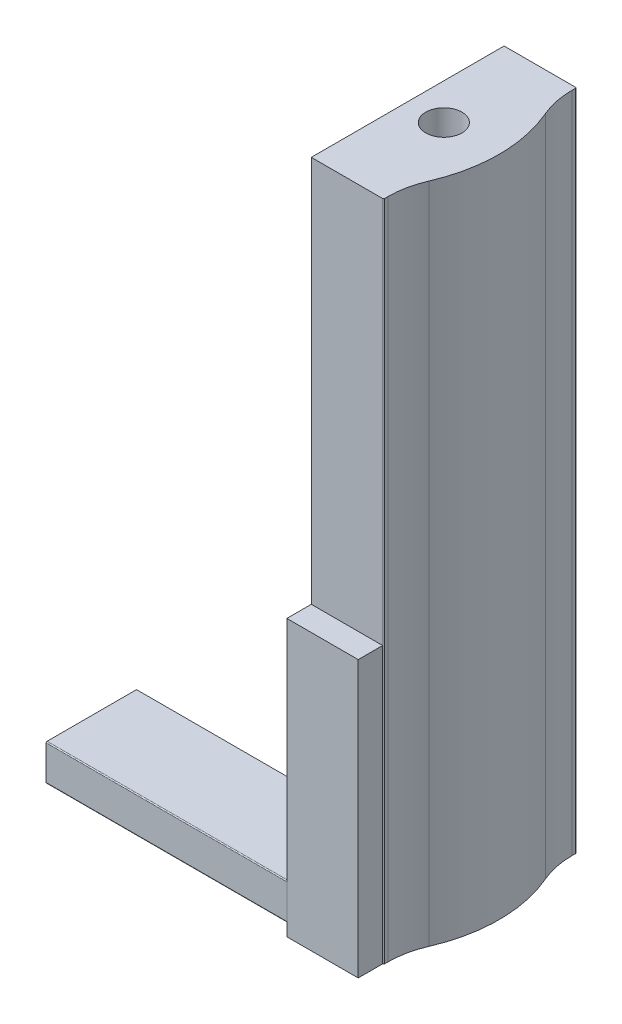
ISO-10303-21;
HEADER;
FILE_DESCRIPTION(('STEP AP214'),'2;1');
FILE_NAME('part.step','',(''),(''),'','','');
FILE_SCHEMA(('AUTOMOTIVE_DESIGN { 1 0 10303 214 1 1 1 1 }'));
ENDSEC;
DATA;
#1=APPLICATION_CONTEXT('core data for automotive mechanical design processes');
#2=APPLICATION_PROTOCOL_DEFINITION('international standard','automotive_design',2000,#1);
#3=PRODUCT_CONTEXT('',#1,'mechanical');
#4=PRODUCT('Part','Part','',(#3));
#5=PRODUCT_RELATED_PRODUCT_CATEGORY('part','',(#4));
#6=PRODUCT_DEFINITION_FORMATION('','',#4);
#7=PRODUCT_DEFINITION_CONTEXT('part definition',#1,'design');
#8=PRODUCT_DEFINITION('design','',#6,#7);
#9=PRODUCT_DEFINITION_SHAPE('','',#8);
#10=(LENGTH_UNIT() NAMED_UNIT(*) SI_UNIT(.MILLI.,.METRE.));
#11=(NAMED_UNIT(*) PLANE_ANGLE_UNIT() SI_UNIT($,.RADIAN.));
#12=(NAMED_UNIT(*) SI_UNIT($,.STERADIAN.) SOLID_ANGLE_UNIT());
#13=UNCERTAINTY_MEASURE_WITH_UNIT(LENGTH_MEASURE(1.E-05),#10,'distance_accuracy_value','');
#14=(GEOMETRIC_REPRESENTATION_CONTEXT(3) GLOBAL_UNCERTAINTY_ASSIGNED_CONTEXT((#13)) GLOBAL_UNIT_ASSIGNED_CONTEXT((#10,
#11,#12)) REPRESENTATION_CONTEXT('',''));
#15=CARTESIAN_POINT('',(0.,0.,0.));
#16=DIRECTION('',(0.,0.,1.));
#17=DIRECTION('',(1.,0.,0.));
#18=AXIS2_PLACEMENT_3D('',#15,#16,#17);
#19=CARTESIAN_POINT('',(1.43662773521287,43.65625,-8.23400967464864));
#20=DIRECTION('',(0.,-1.,0.));
#21=DIRECTION('',(0.,0.,-1.));
#22=AXIS2_PLACEMENT_3D('',#19,#20,#21);
#23=CYLINDRICAL_SURFACE('',#22,0.0634999999999996);
#24=CARTESIAN_POINT('',(1.43662773521287,0.,-8.23400967464864));
#25=DIRECTION('',(0.,1.,0.));
#26=DIRECTION('',(0.,0.,1.));
#27=AXIS2_PLACEMENT_3D('',#24,#25,#26);
#28=CIRCLE('',#27,0.0634999999999996);
#29=CARTESIAN_POINT('',(1.43662773521287,0.,-8.29750967464864));
#30=VERTEX_POINT('',#29);
#31=CARTESIAN_POINT('',(1.50012773521287,0.,-8.23400967464864));
#32=VERTEX_POINT('',#31);
#33=EDGE_CURVE('E250',#30,#32,#28,.F.);
#34=ORIENTED_EDGE('',*,*,#33,.F.);
#35=DIRECTION('',(0.,-1.,0.));
#36=VECTOR('',#35,1.);
#37=CARTESIAN_POINT('',(1.43662773521287,43.65625,-8.29750967464864));
#38=LINE('',#37,#36);
#39=CARTESIAN_POINT('',(1.43662773521287,43.65625,-8.29750967464864));
#40=VERTEX_POINT('',#39);
#41=EDGE_CURVE('E46',#40,#30,#38,.T.);
#42=ORIENTED_EDGE('',*,*,#41,.F.);
#43=CARTESIAN_POINT('',(1.43662773521287,43.65625,-8.23400967464864));
#44=DIRECTION('',(0.,1.,0.));
#45=DIRECTION('',(0.,0.,1.));
#46=AXIS2_PLACEMENT_3D('',#43,#44,#45);
#47=CIRCLE('',#46,0.0634999999999996);
#48=CARTESIAN_POINT('',(1.50012773521287,43.65625,-8.23400967464864));
#49=VERTEX_POINT('',#48);
#50=EDGE_CURVE('E225',#40,#49,#47,.F.);
#51=ORIENTED_EDGE('',*,*,#50,.T.);
#52=DIRECTION('',(0.,-1.,0.));
#53=VECTOR('',#52,1.);
#54=CARTESIAN_POINT('',(1.50012773521287,43.65625,-8.23400967464864));
#55=LINE('',#54,#53);
#56=EDGE_CURVE('E219',#49,#32,#55,.T.);
#57=ORIENTED_EDGE('',*,*,#56,.T.);
#58=EDGE_LOOP('',(#34,#42,#51,#57));
#59=FACE_BOUND('',#58,.T.);
#60=ADVANCED_FACE('F43',(#59),#23,.T.);
#61=CARTESIAN_POINT('',(0.,43.65625,-8.29750967464864));
#62=DIRECTION('',(0.,0.,-1.));
#63=DIRECTION('',(-1.,0.,0.));
#64=AXIS2_PLACEMENT_3D('',#61,#62,#63);
#65=PLANE('',#64);
#66=DIRECTION('',(1.,0.,0.));
#67=VECTOR('',#66,1.);
#68=CARTESIAN_POINT('',(0.,0.,-8.29750967464864));
#69=LINE('',#68,#67);
#70=CARTESIAN_POINT('',(-3.26237226478714,0.,-8.29750967464864));
#71=VERTEX_POINT('',#70);
#72=EDGE_CURVE('E247',#71,#30,#69,.T.);
#73=ORIENTED_EDGE('',*,*,#72,.F.);
#74=DIRECTION('',(0.,-1.,0.));
#75=VECTOR('',#74,1.);
#76=CARTESIAN_POINT('',(-3.26237226478714,43.65625,-8.29750967464864));
#77=LINE('',#76,#75);
#78=CARTESIAN_POINT('',(-3.26237226478714,43.65625,-8.29750967464864));
#79=VERTEX_POINT('',#78);
#80=EDGE_CURVE('E204',#79,#71,#77,.T.);
#81=ORIENTED_EDGE('',*,*,#80,.F.);
#82=DIRECTION('',(1.,0.,0.));
#83=VECTOR('',#82,1.);
#84=CARTESIAN_POINT('',(0.,43.65625,-8.29750967464864));
#85=LINE('',#84,#83);
#86=EDGE_CURVE('E275',#79,#40,#85,.T.);
#87=ORIENTED_EDGE('',*,*,#86,.T.);
#88=ORIENTED_EDGE('',*,*,#41,.T.);
#89=EDGE_LOOP('',(#73,#81,#87,#88));
#90=FACE_BOUND('',#89,.T.);
#91=ADVANCED_FACE('F362',(#90),#65,.T.);
#92=CARTESIAN_POINT('',(-3.26237226478714,43.65625,0.));
#93=DIRECTION('',(-1.,0.,0.));
#94=DIRECTION('',(0.,0.,1.));
#95=AXIS2_PLACEMENT_3D('',#92,#93,#94);
#96=PLANE('',#95);
#97=DIRECTION('',(0.,0.,-1.));
#98=VECTOR('',#97,1.);
#99=CARTESIAN_POINT('',(-3.26237226478714,3.175,0.0368653253513575));
#100=LINE('',#99,#98);
#101=CARTESIAN_POINT('',(-3.26237226478714,3.175,5.92649032535136));
#102=VERTEX_POINT('',#101);
#103=CARTESIAN_POINT('',(-3.26237226478714,3.175,0.0368653253513575));
#104=VERTEX_POINT('',#103);
#105=EDGE_CURVE('E11',#102,#104,#100,.T.);
#106=ORIENTED_EDGE('',*,*,#105,.F.);
#107=CARTESIAN_POINT('',(-3.26237226478714,3.1115,5.92649032535136));
#108=DIRECTION('',(-1.,0.,0.));
#109=DIRECTION('',(0.,0.,1.));
#110=AXIS2_PLACEMENT_3D('',#107,#108,#109);
#111=CIRCLE('',#110,0.0635000000000002);
#112=CARTESIAN_POINT('',(-3.26237226478714,3.1115,5.98999032535136));
#113=VERTEX_POINT('',#112);
#114=EDGE_CURVE('E302',#113,#102,#111,.T.);
#115=ORIENTED_EDGE('',*,*,#114,.F.);
#116=DIRECTION('',(0.,1.,0.));
#117=VECTOR('',#116,1.);
#118=CARTESIAN_POINT('',(-3.26237226478714,3.1115,5.98999032535136));
#119=LINE('',#118,#117);
#120=CARTESIAN_POINT('',(-3.26237226478714,0.85725,5.98999032535136));
#121=VERTEX_POINT('',#120);
#122=EDGE_CURVE('E306',#121,#113,#119,.T.);
#123=ORIENTED_EDGE('',*,*,#122,.F.);
#124=CARTESIAN_POINT('',(-3.26237226478714,0.85725,5.92649032535136));
#125=DIRECTION('',(-1.,0.,0.));
#126=DIRECTION('',(0.,0.,-1.));
#127=AXIS2_PLACEMENT_3D('',#124,#125,#126);
#128=CIRCLE('',#127,0.0635000000000001);
#129=CARTESIAN_POINT('',(-3.26237226478714,0.79375,5.92649032535136));
#130=VERTEX_POINT('',#129);
#131=EDGE_CURVE('E309',#130,#121,#128,.T.);
#132=ORIENTED_EDGE('',*,*,#131,.F.);
#133=DIRECTION('',(0.,0.,1.));
#134=VECTOR('',#133,1.);
#135=CARTESIAN_POINT('',(-3.26237226478714,0.79375,5.92649032535136));
#136=LINE('',#135,#134);
#137=CARTESIAN_POINT('',(-3.26237226478714,0.793749999999999,0.100365325351358));
#138=VERTEX_POINT('',#137);
#139=EDGE_CURVE('E312',#138,#130,#136,.T.);
#140=ORIENTED_EDGE('',*,*,#139,.F.);
#141=CARTESIAN_POINT('',(-3.26237226478714,0.857249999999999,0.100365325351357));
#142=DIRECTION('',(-1.,0.,0.));
#143=DIRECTION('',(0.,0.,-1.));
#144=AXIS2_PLACEMENT_3D('',#141,#142,#143);
#145=CIRCLE('',#144,0.0635);
#146=CARTESIAN_POINT('',(-3.26237226478714,0.857249999999999,0.0368653253513575));
#147=VERTEX_POINT('',#146);
#148=EDGE_CURVE('E62',#147,#138,#145,.T.);
#149=ORIENTED_EDGE('',*,*,#148,.F.);
#150=DIRECTION('',(0.,-1.,0.));
#151=VECTOR('',#150,1.);
#152=CARTESIAN_POINT('',(-3.26237226478714,0.857249999999999,0.0368653253513575));
#153=LINE('',#152,#151);
#154=EDGE_CURVE('E58',#104,#147,#153,.T.);
#155=ORIENTED_EDGE('',*,*,#154,.F.);
#156=EDGE_LOOP('',(#106,#115,#123,#132,#140,#149,#155));
#157=FACE_BOUND('',#156,.T.);
#158=DIRECTION('',(0.,0.,-1.));
#159=VECTOR('',#158,1.);
#160=CARTESIAN_POINT('',(-3.26237226478714,18.161,4.40249032535135));
#161=LINE('',#160,#159);
#162=CARTESIAN_POINT('',(-3.26237226478714,18.161,6.01176945700622));
#163=VERTEX_POINT('',#162);
#164=CARTESIAN_POINT('',(-3.26237226478714,18.161,4.40249032535135));
#165=VERTEX_POINT('',#164);
#166=EDGE_CURVE('E181',#163,#165,#161,.T.);
#167=ORIENTED_EDGE('',*,*,#166,.T.);
#168=DIRECTION('',(0.,-1.,0.));
#169=VECTOR('',#168,1.);
#170=CARTESIAN_POINT('',(-3.26237226478714,43.65625,4.40249032535135));
#171=LINE('',#170,#169);
#172=CARTESIAN_POINT('',(-3.26237226478714,43.65625,4.40249032535135));
#173=VERTEX_POINT('',#172);
#174=EDGE_CURVE('E194',#173,#165,#171,.T.);
#175=ORIENTED_EDGE('',*,*,#174,.F.);
#176=DIRECTION('',(0.,0.,-1.));
#177=VECTOR('',#176,1.);
#178=CARTESIAN_POINT('',(-3.26237226478714,43.65625,0.));
#179=LINE('',#178,#177);
#180=EDGE_CURVE('E273',#173,#79,#179,.T.);
#181=ORIENTED_EDGE('',*,*,#180,.T.);
#182=ORIENTED_EDGE('',*,*,#80,.T.);
#183=DIRECTION('',(0.,0.,-1.));
#184=VECTOR('',#183,1.);
#185=CARTESIAN_POINT('',(-3.26237226478714,0.,0.));
#186=LINE('',#185,#184);
#187=CARTESIAN_POINT('',(-3.26237226478714,0.,6.01176945700622));
#188=VERTEX_POINT('',#187);
#189=EDGE_CURVE('E244',#188,#71,#186,.T.);
#190=ORIENTED_EDGE('',*,*,#189,.F.);
#191=DIRECTION('',(0.,-1.,0.));
#192=VECTOR('',#191,1.);
#193=CARTESIAN_POINT('',(-3.26237226478714,18.161,6.01176945700622));
#194=LINE('',#193,#192);
#195=EDGE_CURVE('E197',#163,#188,#194,.T.);
#196=ORIENTED_EDGE('',*,*,#195,.F.);
#197=EDGE_LOOP('',(#167,#175,#181,#182,#190,#196));
#198=FACE_BOUND('',#197,.T.);
#199=ADVANCED_FACE('F192',(#157,#198),#96,.T.);
#200=CARTESIAN_POINT('',(0.,43.65625,4.40249032535135));
#201=DIRECTION('',(0.,0.,1.));
#202=DIRECTION('',(1.,0.,0.));
#203=AXIS2_PLACEMENT_3D('',#200,#201,#202);
#204=PLANE('',#203);
#205=DIRECTION('',(1.,0.,0.));
#206=VECTOR('',#205,1.);
#207=CARTESIAN_POINT('',(-3.26237226478714,18.161,4.40249032535135));
#208=LINE('',#207,#206);
#209=CARTESIAN_POINT('',(1.43662773521287,18.161,4.40249032535135));
#210=VERTEX_POINT('',#209);
#211=EDGE_CURVE('E177',#165,#210,#208,.T.);
#212=ORIENTED_EDGE('',*,*,#211,.T.);
#213=DIRECTION('',(0.,-1.,0.));
#214=VECTOR('',#213,1.);
#215=CARTESIAN_POINT('',(1.43662773521287,43.65625,4.40249032535135));
#216=LINE('',#215,#214);
#217=CARTESIAN_POINT('',(1.43662773521287,43.65625,4.40249032535135));
#218=VERTEX_POINT('',#217);
#219=EDGE_CURVE('E205',#218,#210,#216,.T.);
#220=ORIENTED_EDGE('',*,*,#219,.F.);
#221=DIRECTION('',(-1.,0.,0.));
#222=VECTOR('',#221,1.);
#223=CARTESIAN_POINT('',(0.,43.65625,4.40249032535135));
#224=LINE('',#223,#222);
#225=EDGE_CURVE('E203',#218,#173,#224,.T.);
#226=ORIENTED_EDGE('',*,*,#225,.T.);
#227=ORIENTED_EDGE('',*,*,#174,.T.);
#228=EDGE_LOOP('',(#212,#220,#226,#227));
#229=FACE_BOUND('',#228,.T.);
#230=ADVANCED_FACE('F201',(#229),#204,.T.);
#231=CARTESIAN_POINT('',(1.43662773521287,43.65625,4.33899032535135));
#232=DIRECTION('',(0.,-1.,0.));
#233=DIRECTION('',(0.,0.,-1.));
#234=AXIS2_PLACEMENT_3D('',#231,#232,#233);
#235=CYLINDRICAL_SURFACE('',#234,0.0635000000000001);
#236=CARTESIAN_POINT('',(1.43662773521287,0.,4.33899032535135));
#237=DIRECTION('',(0.,1.,0.));
#238=DIRECTION('',(0.,0.,1.));
#239=AXIS2_PLACEMENT_3D('',#236,#237,#238);
#240=CIRCLE('',#239,0.0635000000000001);
#241=CARTESIAN_POINT('',(1.50012773521287,0.,4.33899032535135));
#242=VERTEX_POINT('',#241);
#243=CARTESIAN_POINT('',(1.43693305592003,0.,4.40249032535135));
#244=VERTEX_POINT('',#243);
#245=EDGE_CURVE('E241',#242,#244,#240,.F.);
#246=ORIENTED_EDGE('',*,*,#245,.F.);
#247=DIRECTION('',(0.,-1.,0.));
#248=VECTOR('',#247,1.);
#249=CARTESIAN_POINT('',(1.50012773521287,43.65625,4.33899032535135));
#250=LINE('',#249,#248);
#251=CARTESIAN_POINT('',(1.50012773521287,43.65625,4.33899032535135));
#252=VERTEX_POINT('',#251);
#253=EDGE_CURVE('E207',#252,#242,#250,.T.);
#254=ORIENTED_EDGE('',*,*,#253,.F.);
#255=CARTESIAN_POINT('',(1.43662773521287,43.65625,4.33899032535135));
#256=DIRECTION('',(0.,1.,0.));
#257=DIRECTION('',(0.,0.,1.));
#258=AXIS2_PLACEMENT_3D('',#255,#256,#257);
#259=CIRCLE('',#258,0.0635000000000001);
#260=EDGE_CURVE('E269',#252,#218,#259,.F.);
#261=ORIENTED_EDGE('',*,*,#260,.T.);
#262=ORIENTED_EDGE('',*,*,#219,.T.);
#263=CARTESIAN_POINT('',(1.43693305592003,18.161,4.40249032535135));
#264=VERTEX_POINT('',#263);
#265=EDGE_CURVE('E185',#210,#264,#208,.T.);
#266=ORIENTED_EDGE('',*,*,#265,.T.);
#267=DIRECTION('',(0.,-1.,0.));
#268=VECTOR('',#267,1.);
#269=CARTESIAN_POINT('',(1.43693305592003,18.161,4.40249032535135));
#270=LINE('',#269,#268);
#271=EDGE_CURVE('E328',#264,#244,#270,.T.);
#272=ORIENTED_EDGE('',*,*,#271,.T.);
#273=EDGE_LOOP('',(#246,#254,#261,#262,#266,#272));
#274=FACE_BOUND('',#273,.T.);
#275=ADVANCED_FACE('F353',(#274),#235,.T.);
#276=CARTESIAN_POINT('',(1.50012773521287,43.65625,0.));
#277=DIRECTION('',(-1.,0.,0.));
#278=DIRECTION('',(0.,0.,1.));
#279=AXIS2_PLACEMENT_3D('',#276,#277,#278);
#280=PLANE('',#279);
#281=DIRECTION('',(0.,0.,-1.));
#282=VECTOR('',#281,1.);
#283=CARTESIAN_POINT('',(1.50012773521287,0.,0.));
#284=LINE('',#283,#282);
#285=CARTESIAN_POINT('',(1.50012773521287,0.,4.11548777042335));
#286=VERTEX_POINT('',#285);
#287=EDGE_CURVE('E238',#242,#286,#284,.T.);
#288=ORIENTED_EDGE('',*,*,#287,.T.);
#289=DIRECTION('',(0.,-1.,0.));
#290=VECTOR('',#289,1.);
#291=CARTESIAN_POINT('',(1.50012773521287,43.65625,4.11548777042335));
#292=LINE('',#291,#290);
#293=CARTESIAN_POINT('',(1.50012773521287,43.65625,4.11548777042335));
#294=VERTEX_POINT('',#293);
#295=EDGE_CURVE('E211',#294,#286,#292,.T.);
#296=ORIENTED_EDGE('',*,*,#295,.F.);
#297=DIRECTION('',(0.,0.,-1.));
#298=VECTOR('',#297,1.);
#299=CARTESIAN_POINT('',(1.50012773521287,43.65625,0.));
#300=LINE('',#299,#298);
#301=EDGE_CURVE('E267',#252,#294,#300,.T.);
#302=ORIENTED_EDGE('',*,*,#301,.F.);
#303=ORIENTED_EDGE('',*,*,#253,.T.);
#304=EDGE_LOOP('',(#288,#296,#302,#303));
#305=FACE_BOUND('',#304,.T.);
#306=ADVANCED_FACE('F385',(#305),#280,.F.);
#307=CARTESIAN_POINT('',(7.10784830309263,43.65625,4.11548777042335));
#308=DIRECTION('',(0.,-1.,0.));
#309=DIRECTION('',(0.,0.,-1.));
#310=AXIS2_PLACEMENT_3D('',#307,#308,#309);
#311=CYLINDRICAL_SURFACE('',#310,5.60772056787977);
#312=CARTESIAN_POINT('',(7.10784830309263,0.,4.11548777042335));
#313=DIRECTION('',(0.,1.,0.));
#314=DIRECTION('',(0.,0.,1.));
#315=AXIS2_PLACEMENT_3D('',#312,#313,#314);
#316=CIRCLE('',#315,5.60772056787977);
#317=CARTESIAN_POINT('',(1.96112179166361,0.,1.88889032499784));
#318=VERTEX_POINT('',#317);
#319=EDGE_CURVE('E235',#318,#286,#316,.T.);
#320=ORIENTED_EDGE('',*,*,#319,.F.);
#321=DIRECTION('',(0.,-1.,0.));
#322=VECTOR('',#321,1.);
#323=CARTESIAN_POINT('',(1.96112179166361,43.65625,1.88889032499784));
#324=LINE('',#323,#322);
#325=CARTESIAN_POINT('',(1.96112179166361,43.65625,1.88889032499784));
#326=VERTEX_POINT('',#325);
#327=EDGE_CURVE('E213',#326,#318,#324,.T.);
#328=ORIENTED_EDGE('',*,*,#327,.F.);
#329=CARTESIAN_POINT('',(7.10784830309263,43.65625,4.11548777042335));
#330=DIRECTION('',(0.,1.,0.));
#331=DIRECTION('',(0.,0.,1.));
#332=AXIS2_PLACEMENT_3D('',#329,#330,#331);
#333=CIRCLE('',#332,5.60772056787977);
#334=EDGE_CURVE('E264',#326,#294,#333,.T.);
#335=ORIENTED_EDGE('',*,*,#334,.T.);
#336=ORIENTED_EDGE('',*,*,#295,.T.);
#337=EDGE_LOOP('',(#320,#328,#335,#336));
#338=FACE_BOUND('',#337,.T.);
#339=ADVANCED_FACE('F381',(#338),#311,.F.);
#340=CARTESIAN_POINT('',(-6.90662465581038,43.65625,-1.94750967464864));
#341=DIRECTION('',(0.,-1.,0.));
#342=DIRECTION('',(0.,0.,-1.));
#343=AXIS2_PLACEMENT_3D('',#340,#341,#342);
#344=CYLINDRICAL_SURFACE('',#343,9.66203353409494);
#345=CARTESIAN_POINT('',(-6.90662465581038,0.,-1.94750967464864));
#346=DIRECTION('',(0.,1.,0.));
#347=DIRECTION('',(0.,0.,1.));
#348=AXIS2_PLACEMENT_3D('',#345,#346,#347);
#349=CIRCLE('',#348,9.66203353409494);
#350=CARTESIAN_POINT('',(1.96112179166361,0.,-5.78390967429512));
#351=VERTEX_POINT('',#350);
#352=EDGE_CURVE('E232',#351,#318,#349,.F.);
#353=ORIENTED_EDGE('',*,*,#352,.F.);
#354=DIRECTION('',(0.,-1.,0.));
#355=VECTOR('',#354,1.);
#356=CARTESIAN_POINT('',(1.96112179166361,43.65625,-5.78390967429512));
#357=LINE('',#356,#355);
#358=CARTESIAN_POINT('',(1.96112179166361,43.65625,-5.78390967429512));
#359=VERTEX_POINT('',#358);
#360=EDGE_CURVE('E215',#359,#351,#357,.T.);
#361=ORIENTED_EDGE('',*,*,#360,.F.);
#362=CARTESIAN_POINT('',(-6.90662465581038,43.65625,-1.94750967464864));
#363=DIRECTION('',(0.,1.,0.));
#364=DIRECTION('',(0.,0.,1.));
#365=AXIS2_PLACEMENT_3D('',#362,#363,#364);
#366=CIRCLE('',#365,9.66203353409494);
#367=EDGE_CURVE('E261',#359,#326,#366,.F.);
#368=ORIENTED_EDGE('',*,*,#367,.T.);
#369=ORIENTED_EDGE('',*,*,#327,.T.);
#370=EDGE_LOOP('',(#353,#361,#368,#369));
#371=FACE_BOUND('',#370,.T.);
#372=ADVANCED_FACE('F377',(#371),#344,.T.);
#373=CARTESIAN_POINT('',(7.10784830309263,43.65625,-8.01050711972064));
#374=DIRECTION('',(0.,-1.,0.));
#375=DIRECTION('',(0.,0.,-1.));
#376=AXIS2_PLACEMENT_3D('',#373,#374,#375);
#377=CYLINDRICAL_SURFACE('',#376,5.60772056787977);
#378=CARTESIAN_POINT('',(7.10784830309263,0.,-8.01050711972064));
#379=DIRECTION('',(0.,1.,0.));
#380=DIRECTION('',(0.,0.,1.));
#381=AXIS2_PLACEMENT_3D('',#378,#379,#380);
#382=CIRCLE('',#381,5.60772056787977);
#383=CARTESIAN_POINT('',(1.50012773521287,0.,-8.01050711972064));
#384=VERTEX_POINT('',#383);
#385=EDGE_CURVE('E229',#384,#351,#382,.T.);
#386=ORIENTED_EDGE('',*,*,#385,.F.);
#387=DIRECTION('',(0.,-1.,0.));
#388=VECTOR('',#387,1.);
#389=CARTESIAN_POINT('',(1.50012773521287,43.65625,-8.01050711972064));
#390=LINE('',#389,#388);
#391=CARTESIAN_POINT('',(1.50012773521287,43.65625,-8.01050711972064));
#392=VERTEX_POINT('',#391);
#393=EDGE_CURVE('E217',#392,#384,#390,.T.);
#394=ORIENTED_EDGE('',*,*,#393,.F.);
#395=CARTESIAN_POINT('',(7.10784830309263,43.65625,-8.01050711972064));
#396=DIRECTION('',(0.,1.,0.));
#397=DIRECTION('',(0.,0.,1.));
#398=AXIS2_PLACEMENT_3D('',#395,#396,#397);
#399=CIRCLE('',#398,5.60772056787977);
#400=EDGE_CURVE('E258',#392,#359,#399,.T.);
#401=ORIENTED_EDGE('',*,*,#400,.T.);
#402=ORIENTED_EDGE('',*,*,#360,.T.);
#403=EDGE_LOOP('',(#386,#394,#401,#402));
#404=FACE_BOUND('',#403,.T.);
#405=ADVANCED_FACE('F373',(#404),#377,.F.);
#406=CARTESIAN_POINT('',(1.50012773521287,43.65625,0.));
#407=DIRECTION('',(-1.,0.,0.));
#408=DIRECTION('',(0.,0.,1.));
#409=AXIS2_PLACEMENT_3D('',#406,#407,#408);
#410=PLANE('',#409);
#411=DIRECTION('',(0.,0.,-1.));
#412=VECTOR('',#411,1.);
#413=CARTESIAN_POINT('',(1.50012773521287,0.,0.));
#414=LINE('',#413,#412);
#415=EDGE_CURVE('E226',#384,#32,#414,.T.);
#416=ORIENTED_EDGE('',*,*,#415,.T.);
#417=ORIENTED_EDGE('',*,*,#56,.F.);
#418=DIRECTION('',(0.,0.,-1.));
#419=VECTOR('',#418,1.);
#420=CARTESIAN_POINT('',(1.50012773521287,43.65625,0.));
#421=LINE('',#420,#419);
#422=EDGE_CURVE('E256',#392,#49,#421,.T.);
#423=ORIENTED_EDGE('',*,*,#422,.F.);
#424=ORIENTED_EDGE('',*,*,#393,.T.);
#425=EDGE_LOOP('',(#416,#417,#423,#424));
#426=FACE_BOUND('',#425,.T.);
#427=ADVANCED_FACE('F370',(#426),#410,.F.);
#428=CARTESIAN_POINT('',(-0.881122264787135,43.65625,-1.94750967464864));
#429=DIRECTION('',(0.,-1.,0.));
#430=DIRECTION('',(0.,0.,-1.));
#431=AXIS2_PLACEMENT_3D('',#428,#429,#430);
#432=CYLINDRICAL_SURFACE('',#431,1.190625);
#433=CARTESIAN_POINT('',(-0.881122264787135,43.65625,-1.94750967464864));
#434=DIRECTION('',(0.,1.,0.));
#435=DIRECTION('',(0.,0.,1.));
#436=AXIS2_PLACEMENT_3D('',#433,#434,#435);
#437=CIRCLE('',#436,1.190625);
#438=CARTESIAN_POINT('',(-0.881122264787135,43.65625,-0.75688467464864));
#439=VERTEX_POINT('',#438);
#440=EDGE_CURVE('E221',#439,#439,#437,.T.);
#441=ORIENTED_EDGE('',*,*,#440,.T.);
#442=EDGE_LOOP('',(#441));
#443=FACE_BOUND('',#442,.T.);
#444=CARTESIAN_POINT('',(-0.881122264787135,0.,-1.94750967464864));
#445=DIRECTION('',(0.,1.,0.));
#446=DIRECTION('',(0.,0.,1.));
#447=AXIS2_PLACEMENT_3D('',#444,#445,#446);
#448=CIRCLE('',#447,1.190625);
#449=CARTESIAN_POINT('',(-0.881122264787135,0.,-0.75688467464864));
#450=VERTEX_POINT('',#449);
#451=EDGE_CURVE('E222',#450,#450,#448,.T.);
#452=ORIENTED_EDGE('',*,*,#451,.F.);
#453=EDGE_LOOP('',(#452));
#454=FACE_BOUND('',#453,.T.);
#455=ADVANCED_FACE('F557',(#443,#454),#432,.F.);
#456=CARTESIAN_POINT('',(0.,43.65625,0.));
#457=DIRECTION('',(0.,1.,0.));
#458=DIRECTION('',(0.,0.,1.));
#459=AXIS2_PLACEMENT_3D('',#456,#457,#458);
#460=PLANE('',#459);
#461=ORIENTED_EDGE('',*,*,#50,.F.);
#462=ORIENTED_EDGE('',*,*,#86,.F.);
#463=ORIENTED_EDGE('',*,*,#180,.F.);
#464=ORIENTED_EDGE('',*,*,#225,.F.);
#465=ORIENTED_EDGE('',*,*,#260,.F.);
#466=ORIENTED_EDGE('',*,*,#301,.T.);
#467=ORIENTED_EDGE('',*,*,#334,.F.);
#468=ORIENTED_EDGE('',*,*,#367,.F.);
#469=ORIENTED_EDGE('',*,*,#400,.F.);
#470=ORIENTED_EDGE('',*,*,#422,.T.);
#471=EDGE_LOOP('',(#461,#462,#463,#464,#465,#466,#467,#468,#469,#470));
#472=FACE_BOUND('',#471,.T.);
#473=ORIENTED_EDGE('',*,*,#440,.F.);
#474=EDGE_LOOP('',(#473));
#475=FACE_BOUND('',#474,.T.);
#476=ADVANCED_FACE('F357',(#472,#475),#460,.T.);
#477=CARTESIAN_POINT('',(0.,0.,0.));
#478=DIRECTION('',(0.,1.,0.));
#479=DIRECTION('',(0.,0.,1.));
#480=AXIS2_PLACEMENT_3D('',#477,#478,#479);
#481=PLANE('',#480);
#482=ORIENTED_EDGE('',*,*,#245,.T.);
#483=DIRECTION('',(0.,0.,1.));
#484=VECTOR('',#483,1.);
#485=CARTESIAN_POINT('',(1.43693305592003,0.,4.40249032535135));
#486=LINE('',#485,#484);
#487=CARTESIAN_POINT('',(1.43693305592003,0.,6.01176945700622));
#488=VERTEX_POINT('',#487);
#489=EDGE_CURVE('E337',#244,#488,#486,.T.);
#490=ORIENTED_EDGE('',*,*,#489,.T.);
#491=DIRECTION('',(-1.,0.,0.));
#492=VECTOR('',#491,1.);
#493=CARTESIAN_POINT('',(-3.26237226478714,0.,6.01176945700622));
#494=LINE('',#493,#492);
#495=EDGE_CURVE('E198',#488,#188,#494,.T.);
#496=ORIENTED_EDGE('',*,*,#495,.T.);
#497=ORIENTED_EDGE('',*,*,#189,.T.);
#498=ORIENTED_EDGE('',*,*,#72,.T.);
#499=ORIENTED_EDGE('',*,*,#33,.T.);
#500=ORIENTED_EDGE('',*,*,#415,.F.);
#501=ORIENTED_EDGE('',*,*,#385,.T.);
#502=ORIENTED_EDGE('',*,*,#352,.T.);
#503=ORIENTED_EDGE('',*,*,#319,.T.);
#504=ORIENTED_EDGE('',*,*,#287,.F.);
#505=EDGE_LOOP('',(#482,#490,#496,#497,#498,#499,#500,#501,#502,#503,#504));
#506=FACE_BOUND('',#505,.T.);
#507=ORIENTED_EDGE('',*,*,#451,.T.);
#508=EDGE_LOOP('',(#507));
#509=FACE_BOUND('',#508,.T.);
#510=ADVANCED_FACE('F348',(#506,#509),#481,.F.);
#511=CARTESIAN_POINT('',(-19.1373722647871,0.857249999999999,0.100365325351357));
#512=DIRECTION('',(1.,0.,0.));
#513=DIRECTION('',(0.,0.,-1.));
#514=AXIS2_PLACEMENT_3D('',#511,#512,#513);
#515=CYLINDRICAL_SURFACE('',#514,0.0635);
#516=ORIENTED_EDGE('',*,*,#148,.T.);
#517=DIRECTION('',(1.,0.,0.));
#518=VECTOR('',#517,1.);
#519=CARTESIAN_POINT('',(-19.1373722647871,0.793749999999999,0.100365325351358));
#520=LINE('',#519,#518);
#521=CARTESIAN_POINT('',(-19.1373722647871,0.793749999999999,0.100365325351358));
#522=VERTEX_POINT('',#521);
#523=EDGE_CURVE('E253',#522,#138,#520,.T.);
#524=ORIENTED_EDGE('',*,*,#523,.F.);
#525=CARTESIAN_POINT('',(-19.1373722647871,0.857249999999999,0.100365325351357));
#526=DIRECTION('',(-1.,0.,0.));
#527=DIRECTION('',(0.,0.,-1.));
#528=AXIS2_PLACEMENT_3D('',#525,#526,#527);
#529=CIRCLE('',#528,0.0635);
#530=CARTESIAN_POINT('',(-19.1373722647871,0.857249999999999,0.0368653253513575));
#531=VERTEX_POINT('',#530);
#532=EDGE_CURVE('E301',#531,#522,#529,.T.);
#533=ORIENTED_EDGE('',*,*,#532,.F.);
#534=DIRECTION('',(1.,0.,0.));
#535=VECTOR('',#534,1.);
#536=CARTESIAN_POINT('',(-19.1373722647871,0.857249999999999,0.0368653253513575));
#537=LINE('',#536,#535);
#538=EDGE_CURVE('E297',#531,#147,#537,.T.);
#539=ORIENTED_EDGE('',*,*,#538,.T.);
#540=EDGE_LOOP('',(#516,#524,#533,#539));
#541=FACE_BOUND('',#540,.T.);
#542=ADVANCED_FACE('F423',(#541),#515,.T.);
#543=CARTESIAN_POINT('',(-19.1373722647871,0.79375,5.92649032535136));
#544=DIRECTION('',(0.,1.,0.));
#545=DIRECTION('',(0.,0.,1.));
#546=AXIS2_PLACEMENT_3D('',#543,#544,#545);
#547=PLANE('',#546);
#548=ORIENTED_EDGE('',*,*,#139,.T.);
#549=DIRECTION('',(1.,0.,0.));
#550=VECTOR('',#549,1.);
#551=CARTESIAN_POINT('',(-19.1373722647871,0.79375,5.92649032535136));
#552=LINE('',#551,#550);
#553=CARTESIAN_POINT('',(-19.1373722647871,0.79375,5.92649032535136));
#554=VERTEX_POINT('',#553);
#555=EDGE_CURVE('E282',#554,#130,#552,.T.);
#556=ORIENTED_EDGE('',*,*,#555,.F.);
#557=DIRECTION('',(0.,0.,1.));
#558=VECTOR('',#557,1.);
#559=CARTESIAN_POINT('',(-19.1373722647871,0.79375,5.92649032535136));
#560=LINE('',#559,#558);
#561=EDGE_CURVE('E324',#522,#554,#560,.T.);
#562=ORIENTED_EDGE('',*,*,#561,.F.);
#563=ORIENTED_EDGE('',*,*,#523,.T.);
#564=EDGE_LOOP('',(#548,#556,#562,#563));
#565=FACE_BOUND('',#564,.T.);
#566=ADVANCED_FACE('F433',(#565),#547,.F.);
#567=CARTESIAN_POINT('',(-19.1373722647871,0.85725,5.92649032535136));
#568=DIRECTION('',(1.,0.,0.));
#569=DIRECTION('',(0.,0.,-1.));
#570=AXIS2_PLACEMENT_3D('',#567,#568,#569);
#571=CYLINDRICAL_SURFACE('',#570,0.0635000000000001);
#572=ORIENTED_EDGE('',*,*,#131,.T.);
#573=DIRECTION('',(1.,0.,0.));
#574=VECTOR('',#573,1.);
#575=CARTESIAN_POINT('',(-19.1373722647871,0.85725,5.98999032535136));
#576=LINE('',#575,#574);
#577=CARTESIAN_POINT('',(-19.1373722647871,0.85725,5.98999032535136));
#578=VERTEX_POINT('',#577);
#579=EDGE_CURVE('E285',#578,#121,#576,.T.);
#580=ORIENTED_EDGE('',*,*,#579,.F.);
#581=CARTESIAN_POINT('',(-19.1373722647871,0.85725,5.92649032535136));
#582=DIRECTION('',(-1.,0.,0.));
#583=DIRECTION('',(0.,0.,-1.));
#584=AXIS2_PLACEMENT_3D('',#581,#582,#583);
#585=CIRCLE('',#584,0.0635000000000001);
#586=EDGE_CURVE('E322',#554,#578,#585,.T.);
#587=ORIENTED_EDGE('',*,*,#586,.F.);
#588=ORIENTED_EDGE('',*,*,#555,.T.);
#589=EDGE_LOOP('',(#572,#580,#587,#588));
#590=FACE_BOUND('',#589,.T.);
#591=ADVANCED_FACE('F438',(#590),#571,.T.);
#592=CARTESIAN_POINT('',(-19.1373722647871,3.1115,5.98999032535136));
#593=DIRECTION('',(0.,0.,-1.));
#594=DIRECTION('',(-1.,0.,0.));
#595=AXIS2_PLACEMENT_3D('',#592,#593,#594);
#596=PLANE('',#595);
#597=ORIENTED_EDGE('',*,*,#122,.T.);
#598=DIRECTION('',(1.,0.,0.));
#599=VECTOR('',#598,1.);
#600=CARTESIAN_POINT('',(-19.1373722647871,3.1115,5.98999032535136));
#601=LINE('',#600,#599);
#602=CARTESIAN_POINT('',(-19.1373722647871,3.1115,5.98999032535136));
#603=VERTEX_POINT('',#602);
#604=EDGE_CURVE('E288',#603,#113,#601,.T.);
#605=ORIENTED_EDGE('',*,*,#604,.F.);
#606=DIRECTION('',(0.,1.,0.));
#607=VECTOR('',#606,1.);
#608=CARTESIAN_POINT('',(-19.1373722647871,3.1115,5.98999032535136));
#609=LINE('',#608,#607);
#610=EDGE_CURVE('E320',#578,#603,#609,.T.);
#611=ORIENTED_EDGE('',*,*,#610,.F.);
#612=ORIENTED_EDGE('',*,*,#579,.T.);
#613=EDGE_LOOP('',(#597,#605,#611,#612));
#614=FACE_BOUND('',#613,.T.);
#615=ADVANCED_FACE('F450',(#614),#596,.F.);
#616=CARTESIAN_POINT('',(-19.1373722647871,3.1115,5.92649032535136));
#617=DIRECTION('',(1.,0.,0.));
#618=DIRECTION('',(0.,0.,-1.));
#619=AXIS2_PLACEMENT_3D('',#616,#617,#618);
#620=CYLINDRICAL_SURFACE('',#619,0.0635000000000002);
#621=ORIENTED_EDGE('',*,*,#114,.T.);
#622=DIRECTION('',(1.,0.,0.));
#623=VECTOR('',#622,1.);
#624=CARTESIAN_POINT('',(-19.1373722647871,3.175,5.92649032535136));
#625=LINE('',#624,#623);
#626=CARTESIAN_POINT('',(-19.1373722647871,3.175,5.92649032535136));
#627=VERTEX_POINT('',#626);
#628=EDGE_CURVE('E291',#627,#102,#625,.T.);
#629=ORIENTED_EDGE('',*,*,#628,.F.);
#630=CARTESIAN_POINT('',(-19.1373722647871,3.1115,5.92649032535136));
#631=DIRECTION('',(-1.,0.,0.));
#632=DIRECTION('',(0.,0.,1.));
#633=AXIS2_PLACEMENT_3D('',#630,#631,#632);
#634=CIRCLE('',#633,0.0635000000000002);
#635=EDGE_CURVE('E318',#603,#627,#634,.T.);
#636=ORIENTED_EDGE('',*,*,#635,.F.);
#637=ORIENTED_EDGE('',*,*,#604,.T.);
#638=EDGE_LOOP('',(#621,#629,#636,#637));
#639=FACE_BOUND('',#638,.T.);
#640=ADVANCED_FACE('F461',(#639),#620,.T.);
#641=CARTESIAN_POINT('',(-19.1373722647871,3.175,0.0368653253513575));
#642=DIRECTION('',(0.,-1.,0.));
#643=DIRECTION('',(0.,0.,-1.));
#644=AXIS2_PLACEMENT_3D('',#641,#642,#643);
#645=PLANE('',#644);
#646=ORIENTED_EDGE('',*,*,#628,.T.);
#647=ORIENTED_EDGE('',*,*,#105,.T.);
#648=DIRECTION('',(1.,0.,0.));
#649=VECTOR('',#648,1.);
#650=CARTESIAN_POINT('',(-19.1373722647871,3.175,0.0368653253513575));
#651=LINE('',#650,#649);
#652=CARTESIAN_POINT('',(-19.1373722647871,3.175,0.0368653253513575));
#653=VERTEX_POINT('',#652);
#654=EDGE_CURVE('E294',#653,#104,#651,.T.);
#655=ORIENTED_EDGE('',*,*,#654,.F.);
#656=DIRECTION('',(0.,0.,-1.));
#657=VECTOR('',#656,1.);
#658=CARTESIAN_POINT('',(-19.1373722647871,3.175,0.0368653253513575));
#659=LINE('',#658,#657);
#660=EDGE_CURVE('E316',#627,#653,#659,.T.);
#661=ORIENTED_EDGE('',*,*,#660,.F.);
#662=EDGE_LOOP('',(#646,#647,#655,#661));
#663=FACE_BOUND('',#662,.T.);
#664=ADVANCED_FACE('F472',(#663),#645,.F.);
#665=CARTESIAN_POINT('',(-19.1373722647871,0.857249999999999,0.0368653253513575));
#666=DIRECTION('',(0.,0.,1.));
#667=DIRECTION('',(1.,0.,0.));
#668=AXIS2_PLACEMENT_3D('',#665,#666,#667);
#669=PLANE('',#668);
#670=ORIENTED_EDGE('',*,*,#154,.T.);
#671=ORIENTED_EDGE('',*,*,#538,.F.);
#672=DIRECTION('',(0.,-1.,0.));
#673=VECTOR('',#672,1.);
#674=CARTESIAN_POINT('',(-19.1373722647871,0.857249999999999,0.0368653253513575));
#675=LINE('',#674,#673);
#676=EDGE_CURVE('E300',#653,#531,#675,.T.);
#677=ORIENTED_EDGE('',*,*,#676,.F.);
#678=ORIENTED_EDGE('',*,*,#654,.T.);
#679=EDGE_LOOP('',(#670,#671,#677,#678));
#680=FACE_BOUND('',#679,.T.);
#681=ADVANCED_FACE('F483',(#680),#669,.F.);
#682=CARTESIAN_POINT('',(-19.1373722647871,0.857249999999999,0.100365325351357));
#683=DIRECTION('',(1.,0.,0.));
#684=DIRECTION('',(0.,0.,-1.));
#685=AXIS2_PLACEMENT_3D('',#682,#683,#684);
#686=PLANE('',#685);
#687=ORIENTED_EDGE('',*,*,#532,.T.);
#688=ORIENTED_EDGE('',*,*,#561,.T.);
#689=ORIENTED_EDGE('',*,*,#586,.T.);
#690=ORIENTED_EDGE('',*,*,#610,.T.);
#691=ORIENTED_EDGE('',*,*,#635,.T.);
#692=ORIENTED_EDGE('',*,*,#660,.T.);
#693=ORIENTED_EDGE('',*,*,#676,.T.);
#694=EDGE_LOOP('',(#687,#688,#689,#690,#691,#692,#693));
#695=FACE_BOUND('',#694,.T.);
#696=ADVANCED_FACE('F495',(#695),#686,.F.);
#697=CARTESIAN_POINT('',(-3.26237226478714,18.161,6.01176945700622));
#698=DIRECTION('',(0.,0.,1.));
#699=DIRECTION('',(1.,0.,0.));
#700=AXIS2_PLACEMENT_3D('',#697,#698,#699);
#701=PLANE('',#700);
#702=ORIENTED_EDGE('',*,*,#495,.F.);
#703=DIRECTION('',(0.,-1.,0.));
#704=VECTOR('',#703,1.);
#705=CARTESIAN_POINT('',(1.43693305592003,18.161,6.01176945700622));
#706=LINE('',#705,#704);
#707=CARTESIAN_POINT('',(1.43693305592003,18.161,6.01176945700622));
#708=VERTEX_POINT('',#707);
#709=EDGE_CURVE('E331',#708,#488,#706,.T.);
#710=ORIENTED_EDGE('',*,*,#709,.F.);
#711=DIRECTION('',(-1.,0.,0.));
#712=VECTOR('',#711,1.);
#713=CARTESIAN_POINT('',(-3.26237226478714,18.161,6.01176945700622));
#714=LINE('',#713,#712);
#715=EDGE_CURVE('E332',#708,#163,#714,.T.);
#716=ORIENTED_EDGE('',*,*,#715,.T.);
#717=ORIENTED_EDGE('',*,*,#195,.T.);
#718=EDGE_LOOP('',(#702,#710,#716,#717));
#719=FACE_BOUND('',#718,.T.);
#720=ADVANCED_FACE('F346',(#719),#701,.T.);
#721=CARTESIAN_POINT('',(1.43693305592003,18.161,4.40249032535135));
#722=DIRECTION('',(1.,0.,0.));
#723=DIRECTION('',(0.,0.,-1.));
#724=AXIS2_PLACEMENT_3D('',#721,#722,#723);
#725=PLANE('',#724);
#726=ORIENTED_EDGE('',*,*,#489,.F.);
#727=ORIENTED_EDGE('',*,*,#271,.F.);
#728=DIRECTION('',(0.,0.,1.));
#729=VECTOR('',#728,1.);
#730=CARTESIAN_POINT('',(1.43693305592003,18.161,4.40249032535135));
#731=LINE('',#730,#729);
#732=EDGE_CURVE('E189',#264,#708,#731,.T.);
#733=ORIENTED_EDGE('',*,*,#732,.T.);
#734=ORIENTED_EDGE('',*,*,#709,.T.);
#735=EDGE_LOOP('',(#726,#727,#733,#734));
#736=FACE_BOUND('',#735,.T.);
#737=ADVANCED_FACE('F343',(#736),#725,.T.);
#738=CARTESIAN_POINT('',(0.,18.161,0.));
#739=DIRECTION('',(0.,1.,0.));
#740=DIRECTION('',(0.,0.,1.));
#741=AXIS2_PLACEMENT_3D('',#738,#739,#740);
#742=PLANE('',#741);
#743=ORIENTED_EDGE('',*,*,#166,.F.);
#744=ORIENTED_EDGE('',*,*,#715,.F.);
#745=ORIENTED_EDGE('',*,*,#732,.F.);
#746=ORIENTED_EDGE('',*,*,#265,.F.);
#747=ORIENTED_EDGE('',*,*,#211,.F.);
#748=EDGE_LOOP('',(#743,#744,#745,#746,#747));
#749=FACE_BOUND('',#748,.T.);
#750=ADVANCED_FACE('F179',(#749),#742,.T.);
#751=CLOSED_SHELL('',(#60,#91,#199,#230,#275,#306,#339,#372,#405,#427,#455,#476,#510,#542,#566,
#591,#615,#640,#664,#681,#696,#720,#737,#750));
#752=MANIFOLD_SOLID_BREP('B2',#751);
#753=ADVANCED_BREP_SHAPE_REPRESENTATION('',(#18,#752),#14);
#754=SHAPE_DEFINITION_REPRESENTATION(#9,#753);
ENDSEC;
END-ISO-10303-21;
